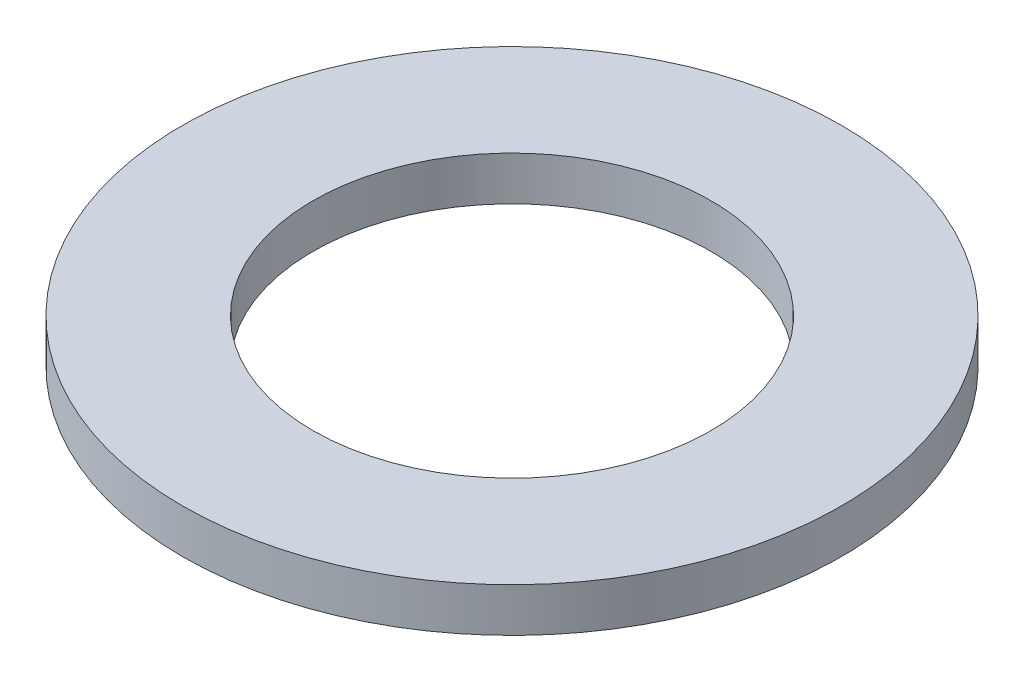
ISO-10303-21;
HEADER;
FILE_DESCRIPTION(('STEP AP214'),'2;1');
FILE_NAME('part.step','',(''),(''),'','','');
FILE_SCHEMA(('AUTOMOTIVE_DESIGN { 1 0 10303 214 1 1 1 1 }'));
ENDSEC;
DATA;
#1=APPLICATION_CONTEXT('core data for automotive mechanical design processes');
#2=APPLICATION_PROTOCOL_DEFINITION('international standard','automotive_design',2000,#1);
#3=PRODUCT_CONTEXT('',#1,'mechanical');
#4=PRODUCT('Part','Part','',(#3));
#5=PRODUCT_RELATED_PRODUCT_CATEGORY('part','',(#4));
#6=PRODUCT_DEFINITION_FORMATION('','',#4);
#7=PRODUCT_DEFINITION_CONTEXT('part definition',#1,'design');
#8=PRODUCT_DEFINITION('design','',#6,#7);
#9=PRODUCT_DEFINITION_SHAPE('','',#8);
#10=(LENGTH_UNIT() NAMED_UNIT(*) SI_UNIT(.MILLI.,.METRE.));
#11=(NAMED_UNIT(*) PLANE_ANGLE_UNIT() SI_UNIT($,.RADIAN.));
#12=(NAMED_UNIT(*) SI_UNIT($,.STERADIAN.) SOLID_ANGLE_UNIT());
#13=UNCERTAINTY_MEASURE_WITH_UNIT(LENGTH_MEASURE(1.E-05),#10,'distance_accuracy_value','');
#14=(GEOMETRIC_REPRESENTATION_CONTEXT(3) GLOBAL_UNCERTAINTY_ASSIGNED_CONTEXT((#13)) GLOBAL_UNIT_ASSIGNED_CONTEXT((#10,
#11,#12)) REPRESENTATION_CONTEXT('',''));
#15=CARTESIAN_POINT('',(0.,0.,0.));
#16=DIRECTION('',(0.,0.,1.));
#17=DIRECTION('',(1.,0.,0.));
#18=AXIS2_PLACEMENT_3D('',#15,#16,#17);
#19=CARTESIAN_POINT('',(0.,1.27,0.));
#20=DIRECTION('',(0.,1.,0.));
#21=DIRECTION('',(0.,0.,1.));
#22=AXIS2_PLACEMENT_3D('',#19,#20,#21);
#23=PLANE('',#22);
#24=CARTESIAN_POINT('',(0.,1.27,0.));
#25=DIRECTION('',(0.,1.,0.));
#26=DIRECTION('',(0.,0.,1.));
#27=AXIS2_PLACEMENT_3D('',#24,#25,#26);
#28=CIRCLE('',#27,9.525);
#29=CARTESIAN_POINT('',(0.,1.27,9.525));
#30=VERTEX_POINT('',#29);
#31=EDGE_CURVE('E10',#30,#30,#28,.T.);
#32=ORIENTED_EDGE('',*,*,#31,.T.);
#33=EDGE_LOOP('',(#32));
#34=FACE_BOUND('',#33,.T.);
#35=CARTESIAN_POINT('',(0.,1.27,0.));
#36=DIRECTION('',(0.,1.,0.));
#37=DIRECTION('',(0.,0.,1.));
#38=AXIS2_PLACEMENT_3D('',#35,#36,#37);
#39=CIRCLE('',#38,5.7546875);
#40=CARTESIAN_POINT('',(0.,1.27,5.7546875));
#41=VERTEX_POINT('',#40);
#42=EDGE_CURVE('E50',#41,#41,#39,.T.);
#43=ORIENTED_EDGE('',*,*,#42,.F.);
#44=EDGE_LOOP('',(#43));
#45=FACE_BOUND('',#44,.T.);
#46=ADVANCED_FACE('F39',(#34,#45),#23,.T.);
#47=CARTESIAN_POINT('',(0.,0.,0.));
#48=DIRECTION('',(0.,1.,0.));
#49=DIRECTION('',(0.,0.,1.));
#50=AXIS2_PLACEMENT_3D('',#47,#48,#49);
#51=PLANE('',#50);
#52=CARTESIAN_POINT('',(0.,0.,0.));
#53=DIRECTION('',(0.,1.,0.));
#54=DIRECTION('',(0.,0.,1.));
#55=AXIS2_PLACEMENT_3D('',#52,#53,#54);
#56=CIRCLE('',#55,9.525);
#57=CARTESIAN_POINT('',(0.,0.,9.525));
#58=VERTEX_POINT('',#57);
#59=EDGE_CURVE('E43',#58,#58,#56,.T.);
#60=ORIENTED_EDGE('',*,*,#59,.F.);
#61=EDGE_LOOP('',(#60));
#62=FACE_BOUND('',#61,.T.);
#63=CARTESIAN_POINT('',(0.,0.,0.));
#64=DIRECTION('',(0.,1.,0.));
#65=DIRECTION('',(0.,0.,1.));
#66=AXIS2_PLACEMENT_3D('',#63,#64,#65);
#67=CIRCLE('',#66,5.7546875);
#68=CARTESIAN_POINT('',(0.,0.,5.7546875));
#69=VERTEX_POINT('',#68);
#70=EDGE_CURVE('E52',#69,#69,#67,.T.);
#71=ORIENTED_EDGE('',*,*,#70,.T.);
#72=EDGE_LOOP('',(#71));
#73=FACE_BOUND('',#72,.T.);
#74=ADVANCED_FACE('F62',(#62,#73),#51,.F.);
#75=CARTESIAN_POINT('',(0.,1.27,0.));
#76=DIRECTION('',(0.,-1.,0.));
#77=DIRECTION('',(0.,0.,-1.));
#78=AXIS2_PLACEMENT_3D('',#75,#76,#77);
#79=CYLINDRICAL_SURFACE('',#78,9.525);
#80=ORIENTED_EDGE('',*,*,#31,.F.);
#81=EDGE_LOOP('',(#80));
#82=FACE_BOUND('',#81,.T.);
#83=ORIENTED_EDGE('',*,*,#59,.T.);
#84=EDGE_LOOP('',(#83));
#85=FACE_BOUND('',#84,.T.);
#86=ADVANCED_FACE('F41',(#82,#85),#79,.T.);
#87=CARTESIAN_POINT('',(0.,1.27,0.));
#88=DIRECTION('',(0.,-1.,0.));
#89=DIRECTION('',(0.,0.,-1.));
#90=AXIS2_PLACEMENT_3D('',#87,#88,#89);
#91=CYLINDRICAL_SURFACE('',#90,5.7546875);
#92=ORIENTED_EDGE('',*,*,#42,.T.);
#93=EDGE_LOOP('',(#92));
#94=FACE_BOUND('',#93,.T.);
#95=ORIENTED_EDGE('',*,*,#70,.F.);
#96=EDGE_LOOP('',(#95));
#97=FACE_BOUND('',#96,.T.);
#98=ADVANCED_FACE('F58',(#94,#97),#91,.F.);
#99=CLOSED_SHELL('',(#46,#74,#86,#98));
#100=MANIFOLD_SOLID_BREP('B2',#99);
#101=ADVANCED_BREP_SHAPE_REPRESENTATION('',(#18,#100),#14);
#102=SHAPE_DEFINITION_REPRESENTATION(#9,#101);
ENDSEC;
END-ISO-10303-21;
